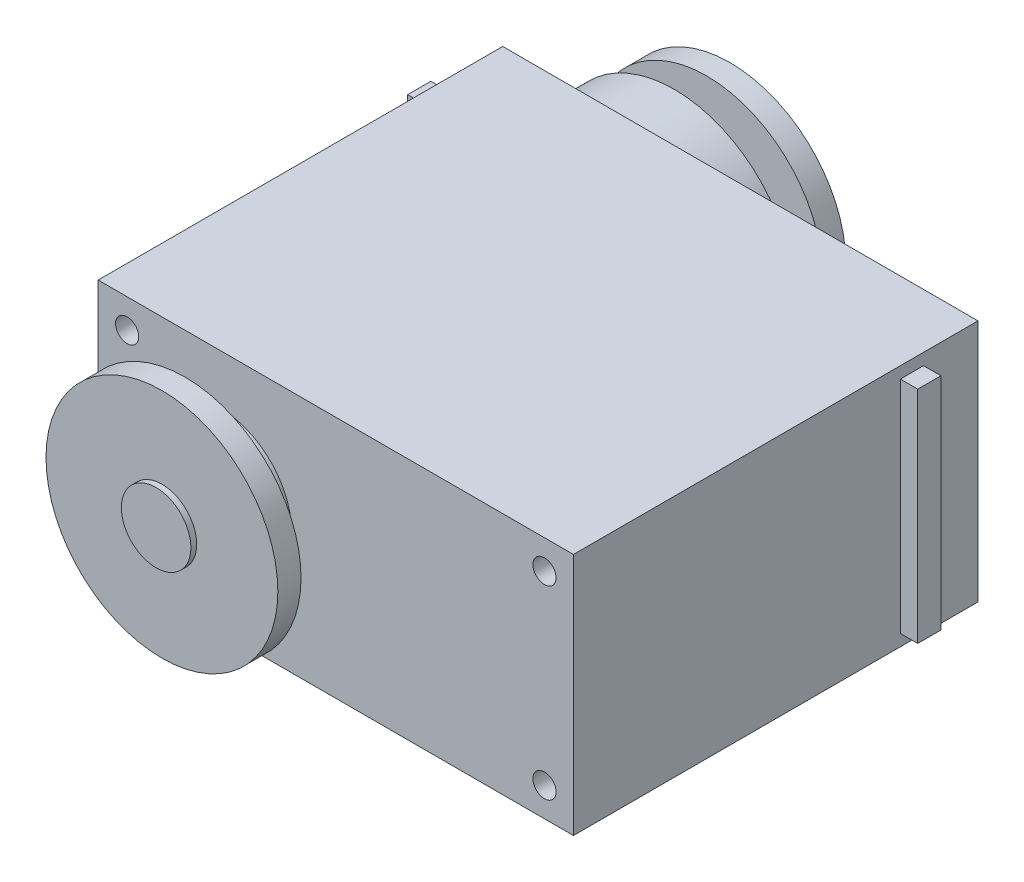
ISO-10303-21;
HEADER;
FILE_DESCRIPTION(('STEP AP214'),'2;1');
FILE_NAME('part.step','',(''),(''),'','','');
FILE_SCHEMA(('AUTOMOTIVE_DESIGN { 1 0 10303 214 1 1 1 1 }'));
ENDSEC;
DATA;
#1=APPLICATION_CONTEXT('core data for automotive mechanical design processes');
#2=APPLICATION_PROTOCOL_DEFINITION('international standard','automotive_design',2000,#1);
#3=PRODUCT_CONTEXT('',#1,'mechanical');
#4=PRODUCT('Part','Part','',(#3));
#5=PRODUCT_RELATED_PRODUCT_CATEGORY('part','',(#4));
#6=PRODUCT_DEFINITION_FORMATION('','',#4);
#7=PRODUCT_DEFINITION_CONTEXT('part definition',#1,'design');
#8=PRODUCT_DEFINITION('design','',#6,#7);
#9=PRODUCT_DEFINITION_SHAPE('','',#8);
#10=(LENGTH_UNIT() NAMED_UNIT(*) SI_UNIT(.MILLI.,.METRE.));
#11=(NAMED_UNIT(*) PLANE_ANGLE_UNIT() SI_UNIT($,.RADIAN.));
#12=(NAMED_UNIT(*) SI_UNIT($,.STERADIAN.) SOLID_ANGLE_UNIT());
#13=UNCERTAINTY_MEASURE_WITH_UNIT(LENGTH_MEASURE(1.E-05),#10,'distance_accuracy_value','');
#14=(GEOMETRIC_REPRESENTATION_CONTEXT(3) GLOBAL_UNCERTAINTY_ASSIGNED_CONTEXT((#13)) GLOBAL_UNIT_ASSIGNED_CONTEXT((#10,
#11,#12)) REPRESENTATION_CONTEXT('',''));
#15=CARTESIAN_POINT('',(0.,0.,0.));
#16=DIRECTION('',(0.,0.,1.));
#17=DIRECTION('',(1.,0.,0.));
#18=AXIS2_PLACEMENT_3D('',#15,#16,#17);
#19=CARTESIAN_POINT('',(-20.5,10.5,34.9));
#20=DIRECTION('',(1.,0.,0.));
#21=DIRECTION('',(0.,1.,0.));
#22=AXIS2_PLACEMENT_3D('',#19,#20,#21);
#23=PLANE('',#22);
#24=DIRECTION('',(0.,-1.,0.));
#25=VECTOR('',#24,1.);
#26=CARTESIAN_POINT('',(-20.5,10.5,0.));
#27=LINE('',#26,#25);
#28=CARTESIAN_POINT('',(-20.5,10.5,0.));
#29=VERTEX_POINT('',#28);
#30=CARTESIAN_POINT('',(-20.5,-10.5,0.));
#31=VERTEX_POINT('',#30);
#32=EDGE_CURVE('E290',#29,#31,#27,.T.);
#33=ORIENTED_EDGE('',*,*,#32,.T.);
#34=DIRECTION('',(0.,0.,-1.));
#35=VECTOR('',#34,1.);
#36=CARTESIAN_POINT('',(-20.5,-10.5,34.9));
#37=LINE('',#36,#35);
#38=CARTESIAN_POINT('',(-20.5,-10.5,34.9));
#39=VERTEX_POINT('',#38);
#40=EDGE_CURVE('E298',#39,#31,#37,.T.);
#41=ORIENTED_EDGE('',*,*,#40,.F.);
#42=DIRECTION('',(0.,-1.,0.));
#43=VECTOR('',#42,1.);
#44=CARTESIAN_POINT('',(-20.5,10.5,34.9));
#45=LINE('',#44,#43);
#46=CARTESIAN_POINT('',(-20.5,10.5,34.9));
#47=VERTEX_POINT('',#46);
#48=EDGE_CURVE('E277',#47,#39,#45,.T.);
#49=ORIENTED_EDGE('',*,*,#48,.F.);
#50=DIRECTION('',(0.,0.,-1.));
#51=VECTOR('',#50,1.);
#52=CARTESIAN_POINT('',(-20.5,10.5,34.9));
#53=LINE('',#52,#51);
#54=EDGE_CURVE('E302',#47,#29,#53,.T.);
#55=ORIENTED_EDGE('',*,*,#54,.T.);
#56=EDGE_LOOP('',(#33,#41,#49,#55));
#57=FACE_BOUND('',#56,.T.);
#58=DIRECTION('',(0.,-1.,0.));
#59=VECTOR('',#58,1.);
#60=CARTESIAN_POINT('',(-20.5,-9.50000000000001,4.7));
#61=LINE('',#60,#59);
#62=CARTESIAN_POINT('',(-20.5,9.49999999999999,4.7));
#63=VERTEX_POINT('',#62);
#64=CARTESIAN_POINT('',(-20.5,-9.50000000000001,4.7));
#65=VERTEX_POINT('',#64);
#66=EDGE_CURVE('E157',#63,#65,#61,.T.);
#67=ORIENTED_EDGE('',*,*,#66,.F.);
#68=DIRECTION('',(0.,0.,-1.));
#69=VECTOR('',#68,1.);
#70=CARTESIAN_POINT('',(-20.5,9.49999999999999,4.7));
#71=LINE('',#70,#69);
#72=CARTESIAN_POINT('',(-20.5,9.49999999999999,6.7));
#73=VERTEX_POINT('',#72);
#74=EDGE_CURVE('E205',#73,#63,#71,.T.);
#75=ORIENTED_EDGE('',*,*,#74,.F.);
#76=DIRECTION('',(0.,1.,0.));
#77=VECTOR('',#76,1.);
#78=CARTESIAN_POINT('',(-20.5,-9.50000000000001,6.7));
#79=LINE('',#78,#77);
#80=CARTESIAN_POINT('',(-20.5,-9.5,6.7));
#81=VERTEX_POINT('',#80);
#82=EDGE_CURVE('E220',#81,#73,#79,.T.);
#83=ORIENTED_EDGE('',*,*,#82,.F.);
#84=DIRECTION('',(0.,0.,1.));
#85=VECTOR('',#84,1.);
#86=CARTESIAN_POINT('',(-20.5,-9.50000000000001,4.7));
#87=LINE('',#86,#85);
#88=EDGE_CURVE('E67',#65,#81,#87,.T.);
#89=ORIENTED_EDGE('',*,*,#88,.F.);
#90=EDGE_LOOP('',(#67,#75,#83,#89));
#91=FACE_BOUND('',#90,.T.);
#92=ADVANCED_FACE('F41',(#57,#91),#23,.F.);
#93=CARTESIAN_POINT('',(20.5,10.5,34.9));
#94=DIRECTION('',(-1.,0.,0.));
#95=DIRECTION('',(0.,-1.,0.));
#96=AXIS2_PLACEMENT_3D('',#93,#94,#95);
#97=PLANE('',#96);
#98=DIRECTION('',(0.,0.,-1.));
#99=VECTOR('',#98,1.);
#100=CARTESIAN_POINT('',(20.5,9.49999999999999,4.7));
#101=LINE('',#100,#99);
#102=CARTESIAN_POINT('',(20.5,9.49999999999999,6.7));
#103=VERTEX_POINT('',#102);
#104=CARTESIAN_POINT('',(20.5,9.49999999999999,4.7));
#105=VERTEX_POINT('',#104);
#106=EDGE_CURVE('E184',#103,#105,#101,.T.);
#107=ORIENTED_EDGE('',*,*,#106,.T.);
#108=DIRECTION('',(0.,-1.,0.));
#109=VECTOR('',#108,1.);
#110=CARTESIAN_POINT('',(20.5,-9.50000000000001,4.7));
#111=LINE('',#110,#109);
#112=CARTESIAN_POINT('',(20.5,-9.50000000000001,4.7));
#113=VERTEX_POINT('',#112);
#114=EDGE_CURVE('E151',#105,#113,#111,.T.);
#115=ORIENTED_EDGE('',*,*,#114,.T.);
#116=DIRECTION('',(0.,0.,1.));
#117=VECTOR('',#116,1.);
#118=CARTESIAN_POINT('',(20.5,-9.50000000000001,4.7));
#119=LINE('',#118,#117);
#120=CARTESIAN_POINT('',(20.5,-9.50000000000001,6.7));
#121=VERTEX_POINT('',#120);
#122=EDGE_CURVE('E169',#113,#121,#119,.T.);
#123=ORIENTED_EDGE('',*,*,#122,.T.);
#124=DIRECTION('',(0.,1.,0.));
#125=VECTOR('',#124,1.);
#126=CARTESIAN_POINT('',(20.5,-9.50000000000001,6.7));
#127=LINE('',#126,#125);
#128=EDGE_CURVE('E59',#121,#103,#127,.T.);
#129=ORIENTED_EDGE('',*,*,#128,.T.);
#130=EDGE_LOOP('',(#107,#115,#123,#129));
#131=FACE_BOUND('',#130,.T.);
#132=DIRECTION('',(0.,1.,0.));
#133=VECTOR('',#132,1.);
#134=CARTESIAN_POINT('',(20.5,10.5,0.));
#135=LINE('',#134,#133);
#136=CARTESIAN_POINT('',(20.5,-10.5,0.));
#137=VERTEX_POINT('',#136);
#138=CARTESIAN_POINT('',(20.5,10.5,0.));
#139=VERTEX_POINT('',#138);
#140=EDGE_CURVE('E268',#137,#139,#135,.T.);
#141=ORIENTED_EDGE('',*,*,#140,.T.);
#142=DIRECTION('',(0.,0.,-1.));
#143=VECTOR('',#142,1.);
#144=CARTESIAN_POINT('',(20.5,10.5,34.9));
#145=LINE('',#144,#143);
#146=CARTESIAN_POINT('',(20.5,10.5,34.9));
#147=VERTEX_POINT('',#146);
#148=EDGE_CURVE('E51',#147,#139,#145,.T.);
#149=ORIENTED_EDGE('',*,*,#148,.F.);
#150=DIRECTION('',(0.,1.,0.));
#151=VECTOR('',#150,1.);
#152=CARTESIAN_POINT('',(20.5,10.5,34.9));
#153=LINE('',#152,#151);
#154=CARTESIAN_POINT('',(20.5,-10.5,34.9));
#155=VERTEX_POINT('',#154);
#156=EDGE_CURVE('E269',#155,#147,#153,.T.);
#157=ORIENTED_EDGE('',*,*,#156,.F.);
#158=DIRECTION('',(0.,0.,-1.));
#159=VECTOR('',#158,1.);
#160=CARTESIAN_POINT('',(20.5,-10.5,34.9));
#161=LINE('',#160,#159);
#162=EDGE_CURVE('E283',#155,#137,#161,.T.);
#163=ORIENTED_EDGE('',*,*,#162,.T.);
#164=EDGE_LOOP('',(#141,#149,#157,#163));
#165=FACE_BOUND('',#164,.T.);
#166=ADVANCED_FACE('F43',(#131,#165),#97,.F.);
#167=CARTESIAN_POINT('',(-20.5,10.5,34.9));
#168=DIRECTION('',(0.,-1.,0.));
#169=DIRECTION('',(0.,0.,-1.));
#170=AXIS2_PLACEMENT_3D('',#167,#168,#169);
#171=PLANE('',#170);
#172=DIRECTION('',(-1.,0.,0.));
#173=VECTOR('',#172,1.);
#174=CARTESIAN_POINT('',(-20.5,10.5,0.));
#175=LINE('',#174,#173);
#176=EDGE_CURVE('E287',#139,#29,#175,.T.);
#177=ORIENTED_EDGE('',*,*,#176,.T.);
#178=ORIENTED_EDGE('',*,*,#54,.F.);
#179=DIRECTION('',(-1.,0.,0.));
#180=VECTOR('',#179,1.);
#181=CARTESIAN_POINT('',(-20.5,10.5,34.9));
#182=LINE('',#181,#180);
#183=EDGE_CURVE('E273',#147,#47,#182,.T.);
#184=ORIENTED_EDGE('',*,*,#183,.F.);
#185=ORIENTED_EDGE('',*,*,#148,.T.);
#186=EDGE_LOOP('',(#177,#178,#184,#185));
#187=FACE_BOUND('',#186,.T.);
#188=ADVANCED_FACE('F309',(#187),#171,.F.);
#189=CARTESIAN_POINT('',(-20.5,-10.5,34.9));
#190=DIRECTION('',(0.,1.,0.));
#191=DIRECTION('',(0.,0.,1.));
#192=AXIS2_PLACEMENT_3D('',#189,#190,#191);
#193=PLANE('',#192);
#194=DIRECTION('',(1.,0.,0.));
#195=VECTOR('',#194,1.);
#196=CARTESIAN_POINT('',(-20.5,-10.5,0.));
#197=LINE('',#196,#195);
#198=EDGE_CURVE('E274',#31,#137,#197,.T.);
#199=ORIENTED_EDGE('',*,*,#198,.T.);
#200=ORIENTED_EDGE('',*,*,#162,.F.);
#201=DIRECTION('',(1.,0.,0.));
#202=VECTOR('',#201,1.);
#203=CARTESIAN_POINT('',(-20.5,-10.5,34.9));
#204=LINE('',#203,#202);
#205=EDGE_CURVE('E280',#39,#155,#204,.T.);
#206=ORIENTED_EDGE('',*,*,#205,.F.);
#207=ORIENTED_EDGE('',*,*,#40,.T.);
#208=EDGE_LOOP('',(#199,#200,#206,#207));
#209=FACE_BOUND('',#208,.T.);
#210=ADVANCED_FACE('F324',(#209),#193,.F.);
#211=CARTESIAN_POINT('',(0.,0.,34.9));
#212=DIRECTION('',(0.,0.,1.));
#213=DIRECTION('',(1.,0.,0.));
#214=AXIS2_PLACEMENT_3D('',#211,#212,#213);
#215=PLANE('',#214);
#216=CARTESIAN_POINT('',(-18.,-7.99999999999999,34.9));
#217=DIRECTION('',(0.,0.,1.));
#218=DIRECTION('',(-1.,0.,0.));
#219=AXIS2_PLACEMENT_3D('',#216,#217,#218);
#220=CIRCLE('',#219,1.);
#221=CARTESIAN_POINT('',(-19.,-7.99999999999999,34.9));
#222=VERTEX_POINT('',#221);
#223=EDGE_CURVE('E753',#222,#222,#220,.T.);
#224=ORIENTED_EDGE('',*,*,#223,.F.);
#225=EDGE_LOOP('',(#224));
#226=FACE_BOUND('',#225,.T.);
#227=CARTESIAN_POINT('',(18.,-8.00000000000001,34.9));
#228=DIRECTION('',(0.,0.,1.));
#229=DIRECTION('',(1.,0.,0.));
#230=AXIS2_PLACEMENT_3D('',#227,#228,#229);
#231=CIRCLE('',#230,1.);
#232=CARTESIAN_POINT('',(19.,-8.00000000000001,34.9));
#233=VERTEX_POINT('',#232);
#234=EDGE_CURVE('E771',#233,#233,#231,.T.);
#235=ORIENTED_EDGE('',*,*,#234,.F.);
#236=EDGE_LOOP('',(#235));
#237=FACE_BOUND('',#236,.T.);
#238=CARTESIAN_POINT('',(18.,8.00000000000001,34.9));
#239=DIRECTION('',(0.,0.,1.));
#240=DIRECTION('',(-1.,0.,0.));
#241=AXIS2_PLACEMENT_3D('',#238,#239,#240);
#242=CIRCLE('',#241,1.);
#243=CARTESIAN_POINT('',(17.,8.00000000000001,34.9));
#244=VERTEX_POINT('',#243);
#245=EDGE_CURVE('E763',#244,#244,#242,.T.);
#246=ORIENTED_EDGE('',*,*,#245,.F.);
#247=EDGE_LOOP('',(#246));
#248=FACE_BOUND('',#247,.T.);
#249=CARTESIAN_POINT('',(-18.,8.,34.9));
#250=DIRECTION('',(0.,0.,1.));
#251=DIRECTION('',(1.,0.,0.));
#252=AXIS2_PLACEMENT_3D('',#249,#250,#251);
#253=CIRCLE('',#252,1.);
#254=CARTESIAN_POINT('',(-17.,8.,34.9));
#255=VERTEX_POINT('',#254);
#256=EDGE_CURVE('E762',#255,#255,#253,.T.);
#257=ORIENTED_EDGE('',*,*,#256,.F.);
#258=EDGE_LOOP('',(#257));
#259=FACE_BOUND('',#258,.T.);
#260=CARTESIAN_POINT('',(-10.,0.,34.9));
#261=DIRECTION('',(0.,0.,1.));
#262=DIRECTION('',(1.,0.,0.));
#263=AXIS2_PLACEMENT_3D('',#260,#261,#262);
#264=CIRCLE('',#263,6.2);
#265=CARTESIAN_POINT('',(-3.8,0.,34.9));
#266=VERTEX_POINT('',#265);
#267=EDGE_CURVE('E793',#266,#266,#264,.T.);
#268=ORIENTED_EDGE('',*,*,#267,.F.);
#269=EDGE_LOOP('',(#268));
#270=FACE_BOUND('',#269,.T.);
#271=ORIENTED_EDGE('',*,*,#156,.T.);
#272=ORIENTED_EDGE('',*,*,#183,.T.);
#273=ORIENTED_EDGE('',*,*,#48,.T.);
#274=ORIENTED_EDGE('',*,*,#205,.T.);
#275=EDGE_LOOP('',(#271,#272,#273,#274));
#276=FACE_BOUND('',#275,.T.);
#277=ADVANCED_FACE('F326',(#226,#237,#248,#259,#270,#276),#215,.T.);
#278=CARTESIAN_POINT('',(0.,0.,0.));
#279=DIRECTION('',(0.,0.,1.));
#280=DIRECTION('',(1.,0.,0.));
#281=AXIS2_PLACEMENT_3D('',#278,#279,#280);
#282=PLANE('',#281);
#283=CARTESIAN_POINT('',(-10.,0.,0.));
#284=DIRECTION('',(0.,0.,-1.));
#285=DIRECTION('',(-1.,0.,0.));
#286=AXIS2_PLACEMENT_3D('',#283,#284,#285);
#287=CIRCLE('',#286,10.4);
#288=CARTESIAN_POINT('',(-1.12544642857143,-5.42238867177967,0.));
#289=VERTEX_POINT('',#288);
#290=CARTESIAN_POINT('',(-1.12544642857143,5.42238867177966,0.));
#291=VERTEX_POINT('',#290);
#292=EDGE_CURVE('E244',#289,#291,#287,.T.);
#293=ORIENTED_EDGE('',*,*,#292,.F.);
#294=CARTESIAN_POINT('',(1.2,0.,0.));
#295=DIRECTION('',(0.,0.,-1.));
#296=DIRECTION('',(-1.,0.,0.));
#297=AXIS2_PLACEMENT_3D('',#294,#295,#296);
#298=CIRCLE('',#297,5.9);
#299=EDGE_CURVE('E251',#291,#289,#298,.T.);
#300=ORIENTED_EDGE('',*,*,#299,.F.);
#301=EDGE_LOOP('',(#293,#300));
#302=FACE_BOUND('',#301,.T.);
#303=ORIENTED_EDGE('',*,*,#140,.F.);
#304=ORIENTED_EDGE('',*,*,#198,.F.);
#305=ORIENTED_EDGE('',*,*,#32,.F.);
#306=ORIENTED_EDGE('',*,*,#176,.F.);
#307=EDGE_LOOP('',(#303,#304,#305,#306));
#308=FACE_BOUND('',#307,.T.);
#309=ADVANCED_FACE('F317',(#302,#308),#282,.F.);
#310=CARTESIAN_POINT('',(-10.,0.,-4.3));
#311=DIRECTION('',(0.,0.,1.));
#312=DIRECTION('',(1.,0.,0.));
#313=AXIS2_PLACEMENT_3D('',#310,#311,#312);
#314=CYLINDRICAL_SURFACE('',#313,10.4);
#315=ORIENTED_EDGE('',*,*,#292,.T.);
#316=DIRECTION('',(0.,0.,1.));
#317=VECTOR('',#316,1.);
#318=CARTESIAN_POINT('',(-1.12544642857143,5.42238867177966,-4.3));
#319=LINE('',#318,#317);
#320=CARTESIAN_POINT('',(-1.12544642857143,5.42238867177966,-4.3));
#321=VERTEX_POINT('',#320);
#322=EDGE_CURVE('E264',#321,#291,#319,.T.);
#323=ORIENTED_EDGE('',*,*,#322,.F.);
#324=CARTESIAN_POINT('',(-10.,0.,-4.3));
#325=DIRECTION('',(0.,0.,-1.));
#326=DIRECTION('',(-1.,0.,0.));
#327=AXIS2_PLACEMENT_3D('',#324,#325,#326);
#328=CIRCLE('',#327,10.4);
#329=CARTESIAN_POINT('',(-1.12544642857143,-5.42238867177967,-4.3));
#330=VERTEX_POINT('',#329);
#331=EDGE_CURVE('E246',#330,#321,#328,.T.);
#332=ORIENTED_EDGE('',*,*,#331,.F.);
#333=DIRECTION('',(0.,0.,1.));
#334=VECTOR('',#333,1.);
#335=CARTESIAN_POINT('',(-1.12544642857143,-5.42238867177967,-4.3));
#336=LINE('',#335,#334);
#337=EDGE_CURVE('E254',#330,#289,#336,.T.);
#338=ORIENTED_EDGE('',*,*,#337,.T.);
#339=EDGE_LOOP('',(#315,#323,#332,#338));
#340=FACE_BOUND('',#339,.T.);
#341=ADVANCED_FACE('F334',(#340),#314,.T.);
#342=CARTESIAN_POINT('',(1.2,0.,-4.3));
#343=DIRECTION('',(0.,0.,1.));
#344=DIRECTION('',(1.,0.,0.));
#345=AXIS2_PLACEMENT_3D('',#342,#343,#344);
#346=CYLINDRICAL_SURFACE('',#345,5.9);
#347=ORIENTED_EDGE('',*,*,#299,.T.);
#348=ORIENTED_EDGE('',*,*,#337,.F.);
#349=CARTESIAN_POINT('',(1.2,0.,-4.3));
#350=DIRECTION('',(0.,0.,-1.));
#351=DIRECTION('',(-1.,0.,0.));
#352=AXIS2_PLACEMENT_3D('',#349,#350,#351);
#353=CIRCLE('',#352,5.9);
#354=EDGE_CURVE('E250',#321,#330,#353,.T.);
#355=ORIENTED_EDGE('',*,*,#354,.F.);
#356=ORIENTED_EDGE('',*,*,#322,.T.);
#357=EDGE_LOOP('',(#347,#348,#355,#356));
#358=FACE_BOUND('',#357,.T.);
#359=ADVANCED_FACE('F372',(#358),#346,.T.);
#360=CARTESIAN_POINT('',(0.,0.,-4.3));
#361=DIRECTION('',(0.,0.,-1.));
#362=DIRECTION('',(-1.,0.,0.));
#363=AXIS2_PLACEMENT_3D('',#360,#361,#362);
#364=PLANE('',#363);
#365=CARTESIAN_POINT('',(-10.,0.,-4.3));
#366=DIRECTION('',(0.,0.,-1.));
#367=DIRECTION('',(-1.,0.,0.));
#368=AXIS2_PLACEMENT_3D('',#365,#366,#367);
#369=CIRCLE('',#368,5.75);
#370=CARTESIAN_POINT('',(-15.75,0.,-4.3));
#371=VERTEX_POINT('',#370);
#372=EDGE_CURVE('E11',#371,#371,#369,.T.);
#373=ORIENTED_EDGE('',*,*,#372,.F.);
#374=EDGE_LOOP('',(#373));
#375=FACE_BOUND('',#374,.T.);
#376=ORIENTED_EDGE('',*,*,#331,.T.);
#377=ORIENTED_EDGE('',*,*,#354,.T.);
#378=EDGE_LOOP('',(#376,#377));
#379=FACE_BOUND('',#378,.T.);
#380=ADVANCED_FACE('F381',(#375,#379),#364,.T.);
#381=CARTESIAN_POINT('',(-10.,0.,-5.5));
#382=DIRECTION('',(0.,0.,1.));
#383=DIRECTION('',(1.,0.,0.));
#384=AXIS2_PLACEMENT_3D('',#381,#382,#383);
#385=CYLINDRICAL_SURFACE('',#384,5.75);
#386=CARTESIAN_POINT('',(-10.,0.,-5.5));
#387=DIRECTION('',(0.,0.,-1.));
#388=DIRECTION('',(-1.,0.,0.));
#389=AXIS2_PLACEMENT_3D('',#386,#387,#388);
#390=CIRCLE('',#389,5.75);
#391=CARTESIAN_POINT('',(-15.75,0.,-5.5));
#392=VERTEX_POINT('',#391);
#393=EDGE_CURVE('E241',#392,#392,#390,.T.);
#394=ORIENTED_EDGE('',*,*,#393,.F.);
#395=EDGE_LOOP('',(#394));
#396=FACE_BOUND('',#395,.T.);
#397=ORIENTED_EDGE('',*,*,#372,.T.);
#398=EDGE_LOOP('',(#397));
#399=FACE_BOUND('',#398,.T.);
#400=ADVANCED_FACE('F392',(#396,#399),#385,.T.);
#401=CARTESIAN_POINT('',(-10.,0.,-5.5));
#402=DIRECTION('',(0.,0.,-1.));
#403=DIRECTION('',(-1.,0.,0.));
#404=AXIS2_PLACEMENT_3D('',#401,#402,#403);
#405=PLANE('',#404);
#406=CARTESIAN_POINT('',(-10.,0.,-5.5));
#407=DIRECTION('',(0.,0.,-1.));
#408=DIRECTION('',(-1.,0.,0.));
#409=AXIS2_PLACEMENT_3D('',#406,#407,#408);
#410=CIRCLE('',#409,5.);
#411=CARTESIAN_POINT('',(-15.,0.,-5.5));
#412=VERTEX_POINT('',#411);
#413=EDGE_CURVE('E733',#412,#412,#410,.T.);
#414=ORIENTED_EDGE('',*,*,#413,.F.);
#415=EDGE_LOOP('',(#414));
#416=FACE_BOUND('',#415,.T.);
#417=ORIENTED_EDGE('',*,*,#393,.T.);
#418=EDGE_LOOP('',(#417));
#419=FACE_BOUND('',#418,.T.);
#420=ADVANCED_FACE('F401',(#416,#419),#405,.T.);
#421=CARTESIAN_POINT('',(-22.,-9.50000000000001,4.7));
#422=DIRECTION('',(0.,0.,1.));
#423=DIRECTION('',(1.,0.,0.));
#424=AXIS2_PLACEMENT_3D('',#421,#422,#423);
#425=PLANE('',#424);
#426=ORIENTED_EDGE('',*,*,#66,.T.);
#427=DIRECTION('',(1.,0.,0.));
#428=VECTOR('',#427,1.);
#429=CARTESIAN_POINT('',(-22.,-9.50000000000001,4.7));
#430=LINE('',#429,#428);
#431=CARTESIAN_POINT('',(-22.,-9.50000000000001,4.7));
#432=VERTEX_POINT('',#431);
#433=EDGE_CURVE('E238',#432,#65,#430,.T.);
#434=ORIENTED_EDGE('',*,*,#433,.F.);
#435=DIRECTION('',(0.,-1.,0.));
#436=VECTOR('',#435,1.);
#437=CARTESIAN_POINT('',(-22.,-9.50000000000001,4.7));
#438=LINE('',#437,#436);
#439=CARTESIAN_POINT('',(-22.,9.49999999999999,4.7));
#440=VERTEX_POINT('',#439);
#441=EDGE_CURVE('E200',#440,#432,#438,.T.);
#442=ORIENTED_EDGE('',*,*,#441,.F.);
#443=DIRECTION('',(1.,0.,0.));
#444=VECTOR('',#443,1.);
#445=CARTESIAN_POINT('',(-22.,9.49999999999999,4.7));
#446=LINE('',#445,#444);
#447=EDGE_CURVE('E214',#440,#63,#446,.T.);
#448=ORIENTED_EDGE('',*,*,#447,.T.);
#449=EDGE_LOOP('',(#426,#434,#442,#448));
#450=FACE_BOUND('',#449,.T.);
#451=ADVANCED_FACE('F415',(#450),#425,.F.);
#452=CARTESIAN_POINT('',(-22.,-9.50000000000001,4.7));
#453=DIRECTION('',(0.,1.,0.));
#454=DIRECTION('',(-1.,0.,0.));
#455=AXIS2_PLACEMENT_3D('',#452,#453,#454);
#456=PLANE('',#455);
#457=ORIENTED_EDGE('',*,*,#88,.T.);
#458=DIRECTION('',(1.,0.,0.));
#459=VECTOR('',#458,1.);
#460=CARTESIAN_POINT('',(-22.,-9.50000000000001,6.7));
#461=LINE('',#460,#459);
#462=CARTESIAN_POINT('',(-22.,-9.50000000000001,6.7));
#463=VERTEX_POINT('',#462);
#464=EDGE_CURVE('E234',#463,#81,#461,.T.);
#465=ORIENTED_EDGE('',*,*,#464,.F.);
#466=DIRECTION('',(0.,0.,1.));
#467=VECTOR('',#466,1.);
#468=CARTESIAN_POINT('',(-22.,-9.50000000000001,4.7));
#469=LINE('',#468,#467);
#470=EDGE_CURVE('E204',#432,#463,#469,.T.);
#471=ORIENTED_EDGE('',*,*,#470,.F.);
#472=ORIENTED_EDGE('',*,*,#433,.T.);
#473=EDGE_LOOP('',(#457,#465,#471,#472));
#474=FACE_BOUND('',#473,.T.);
#475=ADVANCED_FACE('F419',(#474),#456,.F.);
#476=CARTESIAN_POINT('',(-22.,-9.50000000000001,6.7));
#477=DIRECTION('',(0.,0.,-1.));
#478=DIRECTION('',(-1.,0.,0.));
#479=AXIS2_PLACEMENT_3D('',#476,#477,#478);
#480=PLANE('',#479);
#481=ORIENTED_EDGE('',*,*,#82,.T.);
#482=DIRECTION('',(1.,0.,0.));
#483=VECTOR('',#482,1.);
#484=CARTESIAN_POINT('',(-22.,9.49999999999999,6.7));
#485=LINE('',#484,#483);
#486=CARTESIAN_POINT('',(-22.,9.49999999999999,6.7));
#487=VERTEX_POINT('',#486);
#488=EDGE_CURVE('E230',#487,#73,#485,.T.);
#489=ORIENTED_EDGE('',*,*,#488,.F.);
#490=DIRECTION('',(0.,1.,0.));
#491=VECTOR('',#490,1.);
#492=CARTESIAN_POINT('',(-22.,-9.50000000000001,6.7));
#493=LINE('',#492,#491);
#494=EDGE_CURVE('E208',#463,#487,#493,.T.);
#495=ORIENTED_EDGE('',*,*,#494,.F.);
#496=ORIENTED_EDGE('',*,*,#464,.T.);
#497=EDGE_LOOP('',(#481,#489,#495,#496));
#498=FACE_BOUND('',#497,.T.);
#499=ADVANCED_FACE('F429',(#498),#480,.F.);
#500=CARTESIAN_POINT('',(-22.,9.49999999999999,4.7));
#501=DIRECTION('',(0.,-1.,0.));
#502=DIRECTION('',(1.,0.,0.));
#503=AXIS2_PLACEMENT_3D('',#500,#501,#502);
#504=PLANE('',#503);
#505=ORIENTED_EDGE('',*,*,#74,.T.);
#506=ORIENTED_EDGE('',*,*,#447,.F.);
#507=DIRECTION('',(0.,0.,-1.));
#508=VECTOR('',#507,1.);
#509=CARTESIAN_POINT('',(-22.,9.49999999999999,4.7));
#510=LINE('',#509,#508);
#511=EDGE_CURVE('E211',#487,#440,#510,.T.);
#512=ORIENTED_EDGE('',*,*,#511,.F.);
#513=ORIENTED_EDGE('',*,*,#488,.T.);
#514=EDGE_LOOP('',(#505,#506,#512,#513));
#515=FACE_BOUND('',#514,.T.);
#516=ADVANCED_FACE('F439',(#515),#504,.F.);
#517=CARTESIAN_POINT('',(-22.,0.,0.));
#518=DIRECTION('',(1.,0.,0.));
#519=DIRECTION('',(0.,1.,0.));
#520=AXIS2_PLACEMENT_3D('',#517,#518,#519);
#521=PLANE('',#520);
#522=ORIENTED_EDGE('',*,*,#441,.T.);
#523=ORIENTED_EDGE('',*,*,#470,.T.);
#524=ORIENTED_EDGE('',*,*,#494,.T.);
#525=ORIENTED_EDGE('',*,*,#511,.T.);
#526=EDGE_LOOP('',(#522,#523,#524,#525));
#527=FACE_BOUND('',#526,.T.);
#528=ADVANCED_FACE('F449',(#527),#521,.F.);
#529=CARTESIAN_POINT('',(22.,-9.50000000000001,4.7));
#530=DIRECTION('',(0.,0.,-1.));
#531=DIRECTION('',(-1.,0.,0.));
#532=AXIS2_PLACEMENT_3D('',#529,#530,#531);
#533=PLANE('',#532);
#534=ORIENTED_EDGE('',*,*,#114,.F.);
#535=DIRECTION('',(-1.,0.,0.));
#536=VECTOR('',#535,1.);
#537=CARTESIAN_POINT('',(22.,9.49999999999999,4.7));
#538=LINE('',#537,#536);
#539=CARTESIAN_POINT('',(22.,9.49999999999999,4.7));
#540=VERTEX_POINT('',#539);
#541=EDGE_CURVE('E145',#540,#105,#538,.T.);
#542=ORIENTED_EDGE('',*,*,#541,.F.);
#543=DIRECTION('',(0.,-1.,0.));
#544=VECTOR('',#543,1.);
#545=CARTESIAN_POINT('',(22.,-9.50000000000001,4.7));
#546=LINE('',#545,#544);
#547=CARTESIAN_POINT('',(22.,-9.50000000000001,4.7));
#548=VERTEX_POINT('',#547);
#549=EDGE_CURVE('E148',#540,#548,#546,.T.);
#550=ORIENTED_EDGE('',*,*,#549,.T.);
#551=DIRECTION('',(-1.,0.,0.));
#552=VECTOR('',#551,1.);
#553=CARTESIAN_POINT('',(22.,-9.50000000000001,4.7));
#554=LINE('',#553,#552);
#555=EDGE_CURVE('E181',#548,#113,#554,.T.);
#556=ORIENTED_EDGE('',*,*,#555,.T.);
#557=EDGE_LOOP('',(#534,#542,#550,#556));
#558=FACE_BOUND('',#557,.T.);
#559=ADVANCED_FACE('F147',(#558),#533,.T.);
#560=CARTESIAN_POINT('',(22.,9.49999999999999,4.7));
#561=DIRECTION('',(0.,1.,0.));
#562=DIRECTION('',(-1.,0.,0.));
#563=AXIS2_PLACEMENT_3D('',#560,#561,#562);
#564=PLANE('',#563);
#565=ORIENTED_EDGE('',*,*,#106,.F.);
#566=DIRECTION('',(-1.,0.,0.));
#567=VECTOR('',#566,1.);
#568=CARTESIAN_POINT('',(22.,9.49999999999999,6.7));
#569=LINE('',#568,#567);
#570=CARTESIAN_POINT('',(22.,9.49999999999999,6.7));
#571=VERTEX_POINT('',#570);
#572=EDGE_CURVE('E158',#571,#103,#569,.T.);
#573=ORIENTED_EDGE('',*,*,#572,.F.);
#574=DIRECTION('',(0.,0.,-1.));
#575=VECTOR('',#574,1.);
#576=CARTESIAN_POINT('',(22.,9.49999999999999,4.7));
#577=LINE('',#576,#575);
#578=EDGE_CURVE('E164',#571,#540,#577,.T.);
#579=ORIENTED_EDGE('',*,*,#578,.T.);
#580=ORIENTED_EDGE('',*,*,#541,.T.);
#581=EDGE_LOOP('',(#565,#573,#579,#580));
#582=FACE_BOUND('',#581,.T.);
#583=ADVANCED_FACE('F171',(#582),#564,.T.);
#584=CARTESIAN_POINT('',(22.,-9.50000000000001,6.7));
#585=DIRECTION('',(0.,0.,1.));
#586=DIRECTION('',(1.,0.,0.));
#587=AXIS2_PLACEMENT_3D('',#584,#585,#586);
#588=PLANE('',#587);
#589=ORIENTED_EDGE('',*,*,#128,.F.);
#590=DIRECTION('',(-1.,0.,0.));
#591=VECTOR('',#590,1.);
#592=CARTESIAN_POINT('',(22.,-9.50000000000001,6.7));
#593=LINE('',#592,#591);
#594=CARTESIAN_POINT('',(22.,-9.50000000000001,6.7));
#595=VERTEX_POINT('',#594);
#596=EDGE_CURVE('E195',#595,#121,#593,.T.);
#597=ORIENTED_EDGE('',*,*,#596,.F.);
#598=DIRECTION('',(0.,1.,0.));
#599=VECTOR('',#598,1.);
#600=CARTESIAN_POINT('',(22.,-9.50000000000001,6.7));
#601=LINE('',#600,#599);
#602=EDGE_CURVE('E173',#595,#571,#601,.T.);
#603=ORIENTED_EDGE('',*,*,#602,.T.);
#604=ORIENTED_EDGE('',*,*,#572,.T.);
#605=EDGE_LOOP('',(#589,#597,#603,#604));
#606=FACE_BOUND('',#605,.T.);
#607=ADVANCED_FACE('F480',(#606),#588,.T.);
#608=CARTESIAN_POINT('',(22.,-9.50000000000001,4.7));
#609=DIRECTION('',(0.,-1.,0.));
#610=DIRECTION('',(1.,0.,0.));
#611=AXIS2_PLACEMENT_3D('',#608,#609,#610);
#612=PLANE('',#611);
#613=ORIENTED_EDGE('',*,*,#122,.F.);
#614=ORIENTED_EDGE('',*,*,#555,.F.);
#615=DIRECTION('',(0.,0.,1.));
#616=VECTOR('',#615,1.);
#617=CARTESIAN_POINT('',(22.,-9.50000000000001,4.7));
#618=LINE('',#617,#616);
#619=EDGE_CURVE('E167',#548,#595,#618,.T.);
#620=ORIENTED_EDGE('',*,*,#619,.T.);
#621=ORIENTED_EDGE('',*,*,#596,.T.);
#622=EDGE_LOOP('',(#613,#614,#620,#621));
#623=FACE_BOUND('',#622,.T.);
#624=ADVANCED_FACE('F489',(#623),#612,.T.);
#625=CARTESIAN_POINT('',(22.,0.,0.));
#626=DIRECTION('',(-1.,0.,0.));
#627=DIRECTION('',(0.,1.,0.));
#628=AXIS2_PLACEMENT_3D('',#625,#626,#627);
#629=PLANE('',#628);
#630=ORIENTED_EDGE('',*,*,#549,.F.);
#631=ORIENTED_EDGE('',*,*,#578,.F.);
#632=ORIENTED_EDGE('',*,*,#602,.F.);
#633=ORIENTED_EDGE('',*,*,#619,.F.);
#634=EDGE_LOOP('',(#630,#631,#632,#633));
#635=FACE_BOUND('',#634,.T.);
#636=ADVANCED_FACE('F162',(#635),#629,.F.);
#637=CARTESIAN_POINT('',(-10.,0.,36.9));
#638=DIRECTION('',(0.,0.,-1.));
#639=DIRECTION('',(-1.,0.,0.));
#640=AXIS2_PLACEMENT_3D('',#637,#638,#639);
#641=CYLINDRICAL_SURFACE('',#640,6.2);
#642=CARTESIAN_POINT('',(-10.,0.,36.9));
#643=DIRECTION('',(0.,0.,1.));
#644=DIRECTION('',(1.,0.,0.));
#645=AXIS2_PLACEMENT_3D('',#642,#643,#644);
#646=CIRCLE('',#645,6.2);
#647=CARTESIAN_POINT('',(-3.8,0.,36.9));
#648=VERTEX_POINT('',#647);
#649=EDGE_CURVE('E185',#648,#648,#646,.T.);
#650=ORIENTED_EDGE('',*,*,#649,.F.);
#651=EDGE_LOOP('',(#650));
#652=FACE_BOUND('',#651,.T.);
#653=ORIENTED_EDGE('',*,*,#267,.T.);
#654=EDGE_LOOP('',(#653));
#655=FACE_BOUND('',#654,.T.);
#656=ADVANCED_FACE('F507',(#652,#655),#641,.T.);
#657=CARTESIAN_POINT('',(-10.,0.,36.9));
#658=DIRECTION('',(0.,0.,1.));
#659=DIRECTION('',(1.,0.,0.));
#660=AXIS2_PLACEMENT_3D('',#657,#658,#659);
#661=PLANE('',#660);
#662=CARTESIAN_POINT('',(-10.,0.,36.9));
#663=DIRECTION('',(0.,0.,1.));
#664=DIRECTION('',(1.,0.,0.));
#665=AXIS2_PLACEMENT_3D('',#662,#663,#664);
#666=CIRCLE('',#665,5.);
#667=CARTESIAN_POINT('',(-5.,0.,36.9));
#668=VERTEX_POINT('',#667);
#669=EDGE_CURVE('E754',#668,#668,#666,.T.);
#670=ORIENTED_EDGE('',*,*,#669,.F.);
#671=EDGE_LOOP('',(#670));
#672=FACE_BOUND('',#671,.T.);
#673=ORIENTED_EDGE('',*,*,#649,.T.);
#674=EDGE_LOOP('',(#673));
#675=FACE_BOUND('',#674,.T.);
#676=ADVANCED_FACE('F516',(#672,#675),#661,.T.);
#677=CARTESIAN_POINT('',(-18.,8.,24.9));
#678=DIRECTION('',(0.,0.,1.));
#679=DIRECTION('',(1.,0.,0.));
#680=AXIS2_PLACEMENT_3D('',#677,#678,#679);
#681=CYLINDRICAL_SURFACE('',#680,1.);
#682=CARTESIAN_POINT('',(-18.,8.,24.9));
#683=DIRECTION('',(0.,0.,1.));
#684=DIRECTION('',(1.,0.,0.));
#685=AXIS2_PLACEMENT_3D('',#682,#683,#684);
#686=CIRCLE('',#685,1.);
#687=CARTESIAN_POINT('',(-17.,8.,24.9));
#688=VERTEX_POINT('',#687);
#689=EDGE_CURVE('E782',#688,#688,#686,.T.);
#690=ORIENTED_EDGE('',*,*,#689,.F.);
#691=EDGE_LOOP('',(#690));
#692=FACE_BOUND('',#691,.T.);
#693=ORIENTED_EDGE('',*,*,#256,.T.);
#694=EDGE_LOOP('',(#693));
#695=FACE_BOUND('',#694,.T.);
#696=ADVANCED_FACE('F543',(#692,#695),#681,.F.);
#697=CARTESIAN_POINT('',(-18.,8.,24.9));
#698=DIRECTION('',(0.,0.,1.));
#699=DIRECTION('',(1.,0.,0.));
#700=AXIS2_PLACEMENT_3D('',#697,#698,#699);
#701=PLANE('',#700);
#702=ORIENTED_EDGE('',*,*,#689,.T.);
#703=EDGE_LOOP('',(#702));
#704=FACE_BOUND('',#703,.T.);
#705=ADVANCED_FACE('F547',(#704),#701,.T.);
#706=CARTESIAN_POINT('',(18.,8.00000000000001,24.9));
#707=DIRECTION('',(0.,0.,1.));
#708=DIRECTION('',(1.,0.,0.));
#709=AXIS2_PLACEMENT_3D('',#706,#707,#708);
#710=CYLINDRICAL_SURFACE('',#709,1.);
#711=CARTESIAN_POINT('',(18.,8.00000000000001,24.9));
#712=DIRECTION('',(0.,0.,1.));
#713=DIRECTION('',(-1.,0.,0.));
#714=AXIS2_PLACEMENT_3D('',#711,#712,#713);
#715=CIRCLE('',#714,1.);
#716=CARTESIAN_POINT('',(17.,8.00000000000001,24.9));
#717=VERTEX_POINT('',#716);
#718=EDGE_CURVE('E758',#717,#717,#715,.T.);
#719=ORIENTED_EDGE('',*,*,#718,.F.);
#720=EDGE_LOOP('',(#719));
#721=FACE_BOUND('',#720,.T.);
#722=ORIENTED_EDGE('',*,*,#245,.T.);
#723=EDGE_LOOP('',(#722));
#724=FACE_BOUND('',#723,.T.);
#725=ADVANCED_FACE('F557',(#721,#724),#710,.F.);
#726=CARTESIAN_POINT('',(18.,8.00000000000001,24.9));
#727=DIRECTION('',(0.,0.,-1.));
#728=DIRECTION('',(-1.,0.,0.));
#729=AXIS2_PLACEMENT_3D('',#726,#727,#728);
#730=PLANE('',#729);
#731=ORIENTED_EDGE('',*,*,#718,.T.);
#732=EDGE_LOOP('',(#731));
#733=FACE_BOUND('',#732,.T.);
#734=ADVANCED_FACE('F567',(#733),#730,.F.);
#735=CARTESIAN_POINT('',(18.,-8.00000000000001,24.9));
#736=DIRECTION('',(0.,0.,1.));
#737=DIRECTION('',(1.,0.,0.));
#738=AXIS2_PLACEMENT_3D('',#735,#736,#737);
#739=CYLINDRICAL_SURFACE('',#738,1.);
#740=CARTESIAN_POINT('',(18.,-8.00000000000001,24.9));
#741=DIRECTION('',(0.,0.,1.));
#742=DIRECTION('',(1.,0.,0.));
#743=AXIS2_PLACEMENT_3D('',#740,#741,#742);
#744=CIRCLE('',#743,1.);
#745=CARTESIAN_POINT('',(19.,-8.00000000000001,24.9));
#746=VERTEX_POINT('',#745);
#747=EDGE_CURVE('E767',#746,#746,#744,.T.);
#748=ORIENTED_EDGE('',*,*,#747,.F.);
#749=EDGE_LOOP('',(#748));
#750=FACE_BOUND('',#749,.T.);
#751=ORIENTED_EDGE('',*,*,#234,.T.);
#752=EDGE_LOOP('',(#751));
#753=FACE_BOUND('',#752,.T.);
#754=ADVANCED_FACE('F577',(#750,#753),#739,.F.);
#755=CARTESIAN_POINT('',(18.,-8.00000000000001,24.9));
#756=DIRECTION('',(0.,0.,1.));
#757=DIRECTION('',(1.,0.,0.));
#758=AXIS2_PLACEMENT_3D('',#755,#756,#757);
#759=PLANE('',#758);
#760=ORIENTED_EDGE('',*,*,#747,.T.);
#761=EDGE_LOOP('',(#760));
#762=FACE_BOUND('',#761,.T.);
#763=ADVANCED_FACE('F587',(#762),#759,.T.);
#764=CARTESIAN_POINT('',(-18.,-7.99999999999999,24.9));
#765=DIRECTION('',(0.,0.,1.));
#766=DIRECTION('',(1.,0.,0.));
#767=AXIS2_PLACEMENT_3D('',#764,#765,#766);
#768=CYLINDRICAL_SURFACE('',#767,1.);
#769=CARTESIAN_POINT('',(-18.,-7.99999999999999,24.9));
#770=DIRECTION('',(0.,0.,1.));
#771=DIRECTION('',(-1.,0.,0.));
#772=AXIS2_PLACEMENT_3D('',#769,#770,#771);
#773=CIRCLE('',#772,1.);
#774=CARTESIAN_POINT('',(-19.,-7.99999999999999,24.9));
#775=VERTEX_POINT('',#774);
#776=EDGE_CURVE('E775',#775,#775,#773,.T.);
#777=ORIENTED_EDGE('',*,*,#776,.F.);
#778=EDGE_LOOP('',(#777));
#779=FACE_BOUND('',#778,.T.);
#780=ORIENTED_EDGE('',*,*,#223,.T.);
#781=EDGE_LOOP('',(#780));
#782=FACE_BOUND('',#781,.T.);
#783=ADVANCED_FACE('F597',(#779,#782),#768,.F.);
#784=CARTESIAN_POINT('',(-18.,-7.99999999999999,24.9));
#785=DIRECTION('',(0.,0.,-1.));
#786=DIRECTION('',(-1.,0.,0.));
#787=AXIS2_PLACEMENT_3D('',#784,#785,#786);
#788=PLANE('',#787);
#789=ORIENTED_EDGE('',*,*,#776,.T.);
#790=EDGE_LOOP('',(#789));
#791=FACE_BOUND('',#790,.T.);
#792=ADVANCED_FACE('F607',(#791),#788,.F.);
#793=CARTESIAN_POINT('',(-10.,0.,37.9));
#794=DIRECTION('',(0.,0.,-1.));
#795=DIRECTION('',(-1.,0.,0.));
#796=AXIS2_PLACEMENT_3D('',#793,#794,#795);
#797=CYLINDRICAL_SURFACE('',#796,5.);
#798=CARTESIAN_POINT('',(-10.,0.,37.9));
#799=DIRECTION('',(0.,0.,1.));
#800=DIRECTION('',(1.,0.,0.));
#801=AXIS2_PLACEMENT_3D('',#798,#799,#800);
#802=CIRCLE('',#801,5.);
#803=CARTESIAN_POINT('',(-5.,0.,37.9));
#804=VERTEX_POINT('',#803);
#805=EDGE_CURVE('E749',#804,#804,#802,.T.);
#806=ORIENTED_EDGE('',*,*,#805,.F.);
#807=EDGE_LOOP('',(#806));
#808=FACE_BOUND('',#807,.T.);
#809=ORIENTED_EDGE('',*,*,#669,.T.);
#810=EDGE_LOOP('',(#809));
#811=FACE_BOUND('',#810,.T.);
#812=ADVANCED_FACE('F617',(#808,#811),#797,.T.);
#813=CARTESIAN_POINT('',(-10.,0.,39.9));
#814=DIRECTION('',(0.,0.,-1.));
#815=DIRECTION('',(-1.,0.,0.));
#816=AXIS2_PLACEMENT_3D('',#813,#814,#815);
#817=CYLINDRICAL_SURFACE('',#816,10.);
#818=CARTESIAN_POINT('',(-10.,0.,39.9));
#819=DIRECTION('',(0.,0.,1.));
#820=DIRECTION('',(1.,0.,0.));
#821=AXIS2_PLACEMENT_3D('',#818,#819,#820);
#822=CIRCLE('',#821,10.);
#823=CARTESIAN_POINT('',(0.,0.,39.9));
#824=VERTEX_POINT('',#823);
#825=EDGE_CURVE('E742',#824,#824,#822,.T.);
#826=ORIENTED_EDGE('',*,*,#825,.F.);
#827=EDGE_LOOP('',(#826));
#828=FACE_BOUND('',#827,.T.);
#829=CARTESIAN_POINT('',(-10.,0.,37.9));
#830=DIRECTION('',(0.,0.,1.));
#831=DIRECTION('',(1.,0.,0.));
#832=AXIS2_PLACEMENT_3D('',#829,#830,#831);
#833=CIRCLE('',#832,10.);
#834=CARTESIAN_POINT('',(0.,0.,37.9));
#835=VERTEX_POINT('',#834);
#836=EDGE_CURVE('E738',#835,#835,#833,.T.);
#837=ORIENTED_EDGE('',*,*,#836,.T.);
#838=EDGE_LOOP('',(#837));
#839=FACE_BOUND('',#838,.T.);
#840=ADVANCED_FACE('F634',(#828,#839),#817,.T.);
#841=CARTESIAN_POINT('',(-10.,0.,39.9));
#842=DIRECTION('',(0.,0.,1.));
#843=DIRECTION('',(1.,0.,0.));
#844=AXIS2_PLACEMENT_3D('',#841,#842,#843);
#845=PLANE('',#844);
#846=CARTESIAN_POINT('',(-10.,0.,39.9));
#847=DIRECTION('',(0.,0.,1.));
#848=DIRECTION('',(1.,0.,0.));
#849=AXIS2_PLACEMENT_3D('',#846,#847,#848);
#850=CIRCLE('',#849,3.);
#851=CARTESIAN_POINT('',(-7.,0.,39.9));
#852=VERTEX_POINT('',#851);
#853=EDGE_CURVE('E45',#852,#852,#850,.T.);
#854=ORIENTED_EDGE('',*,*,#853,.F.);
#855=EDGE_LOOP('',(#854));
#856=FACE_BOUND('',#855,.T.);
#857=ORIENTED_EDGE('',*,*,#825,.T.);
#858=EDGE_LOOP('',(#857));
#859=FACE_BOUND('',#858,.T.);
#860=ADVANCED_FACE('F644',(#856,#859),#845,.T.);
#861=CARTESIAN_POINT('',(-10.,0.,37.9));
#862=DIRECTION('',(0.,0.,1.));
#863=DIRECTION('',(1.,0.,0.));
#864=AXIS2_PLACEMENT_3D('',#861,#862,#863);
#865=PLANE('',#864);
#866=ORIENTED_EDGE('',*,*,#805,.T.);
#867=EDGE_LOOP('',(#866));
#868=FACE_BOUND('',#867,.T.);
#869=ORIENTED_EDGE('',*,*,#836,.F.);
#870=EDGE_LOOP('',(#869));
#871=FACE_BOUND('',#870,.T.);
#872=ADVANCED_FACE('F529',(#868,#871),#865,.F.);
#873=CARTESIAN_POINT('',(-10.,0.,40.4));
#874=DIRECTION('',(0.,0.,1.));
#875=DIRECTION('',(1.,0.,0.));
#876=AXIS2_PLACEMENT_3D('',#873,#874,#875);
#877=PLANE('',#876);
#878=CARTESIAN_POINT('',(-10.,0.,40.4));
#879=DIRECTION('',(0.,0.,1.));
#880=DIRECTION('',(1.,0.,0.));
#881=AXIS2_PLACEMENT_3D('',#878,#879,#880);
#882=CIRCLE('',#881,3.);
#883=CARTESIAN_POINT('',(-7.,0.,40.4));
#884=VERTEX_POINT('',#883);
#885=EDGE_CURVE('E786',#884,#884,#882,.T.);
#886=ORIENTED_EDGE('',*,*,#885,.T.);
#887=EDGE_LOOP('',(#886));
#888=FACE_BOUND('',#887,.T.);
#889=ADVANCED_FACE('F524',(#888),#877,.T.);
#890=CARTESIAN_POINT('',(-10.,0.,40.4));
#891=DIRECTION('',(0.,0.,-1.));
#892=DIRECTION('',(-1.,0.,0.));
#893=AXIS2_PLACEMENT_3D('',#890,#891,#892);
#894=CYLINDRICAL_SURFACE('',#893,3.);
#895=ORIENTED_EDGE('',*,*,#853,.T.);
#896=EDGE_LOOP('',(#895));
#897=FACE_BOUND('',#896,.T.);
#898=ORIENTED_EDGE('',*,*,#885,.F.);
#899=EDGE_LOOP('',(#898));
#900=FACE_BOUND('',#899,.T.);
#901=ADVANCED_FACE('F528',(#897,#900),#894,.T.);
#902=CARTESIAN_POINT('',(-10.,0.,-7.1));
#903=DIRECTION('',(0.,0.,1.));
#904=DIRECTION('',(1.,0.,0.));
#905=AXIS2_PLACEMENT_3D('',#902,#903,#904);
#906=CYLINDRICAL_SURFACE('',#905,5.);
#907=CARTESIAN_POINT('',(-10.,0.,-7.1));
#908=DIRECTION('',(0.,0.,-1.));
#909=DIRECTION('',(-1.,0.,0.));
#910=AXIS2_PLACEMENT_3D('',#907,#908,#909);
#911=CIRCLE('',#910,5.);
#912=CARTESIAN_POINT('',(-15.,0.,-7.1));
#913=VERTEX_POINT('',#912);
#914=EDGE_CURVE('E723',#913,#913,#911,.T.);
#915=ORIENTED_EDGE('',*,*,#914,.F.);
#916=EDGE_LOOP('',(#915));
#917=FACE_BOUND('',#916,.T.);
#918=ORIENTED_EDGE('',*,*,#413,.T.);
#919=EDGE_LOOP('',(#918));
#920=FACE_BOUND('',#919,.T.);
#921=ADVANCED_FACE('F670',(#917,#920),#906,.T.);
#922=CARTESIAN_POINT('',(-10.,0.,-9.1));
#923=DIRECTION('',(0.,0.,1.));
#924=DIRECTION('',(1.,0.,0.));
#925=AXIS2_PLACEMENT_3D('',#922,#923,#924);
#926=CYLINDRICAL_SURFACE('',#925,10.);
#927=CARTESIAN_POINT('',(-10.,0.,-9.1));
#928=DIRECTION('',(0.,0.,-1.));
#929=DIRECTION('',(-1.,0.,0.));
#930=AXIS2_PLACEMENT_3D('',#927,#928,#929);
#931=CIRCLE('',#930,10.);
#932=CARTESIAN_POINT('',(-20.,0.,-9.1));
#933=VERTEX_POINT('',#932);
#934=EDGE_CURVE('E729',#933,#933,#931,.T.);
#935=ORIENTED_EDGE('',*,*,#934,.F.);
#936=EDGE_LOOP('',(#935));
#937=FACE_BOUND('',#936,.T.);
#938=CARTESIAN_POINT('',(-10.,0.,-7.1));
#939=DIRECTION('',(0.,0.,-1.));
#940=DIRECTION('',(-1.,0.,0.));
#941=AXIS2_PLACEMENT_3D('',#938,#939,#940);
#942=CIRCLE('',#941,10.);
#943=CARTESIAN_POINT('',(-20.,0.,-7.1));
#944=VERTEX_POINT('',#943);
#945=EDGE_CURVE('E726',#944,#944,#942,.T.);
#946=ORIENTED_EDGE('',*,*,#945,.T.);
#947=EDGE_LOOP('',(#946));
#948=FACE_BOUND('',#947,.T.);
#949=ADVANCED_FACE('F686',(#937,#948),#926,.T.);
#950=CARTESIAN_POINT('',(-10.,0.,-9.1));
#951=DIRECTION('',(0.,0.,-1.));
#952=DIRECTION('',(-1.,0.,0.));
#953=AXIS2_PLACEMENT_3D('',#950,#951,#952);
#954=PLANE('',#953);
#955=ORIENTED_EDGE('',*,*,#934,.T.);
#956=EDGE_LOOP('',(#955));
#957=FACE_BOUND('',#956,.T.);
#958=ADVANCED_FACE('F696',(#957),#954,.T.);
#959=CARTESIAN_POINT('',(-10.,0.,-7.1));
#960=DIRECTION('',(0.,0.,-1.));
#961=DIRECTION('',(-1.,0.,0.));
#962=AXIS2_PLACEMENT_3D('',#959,#960,#961);
#963=PLANE('',#962);
#964=ORIENTED_EDGE('',*,*,#914,.T.);
#965=EDGE_LOOP('',(#964));
#966=FACE_BOUND('',#965,.T.);
#967=ORIENTED_EDGE('',*,*,#945,.F.);
#968=EDGE_LOOP('',(#967));
#969=FACE_BOUND('',#968,.T.);
#970=ADVANCED_FACE('F706',(#966,#969),#963,.F.);
#971=CLOSED_SHELL('',(#92,#166,#188,#210,#277,#309,#341,#359,#380,#400,#420,#451,#475,#499,#516,
#528,#559,#583,#607,#624,#636,#656,#676,#696,#705,#725,#734,#754,#763,#783,#792,#812,#840,#860,
#872,#889,#901,#921,#949,#958,#970));
#972=MANIFOLD_SOLID_BREP('B2',#971);
#973=ADVANCED_BREP_SHAPE_REPRESENTATION('',(#18,#972),#14);
#974=SHAPE_DEFINITION_REPRESENTATION(#9,#973);
ENDSEC;
END-ISO-10303-21;
